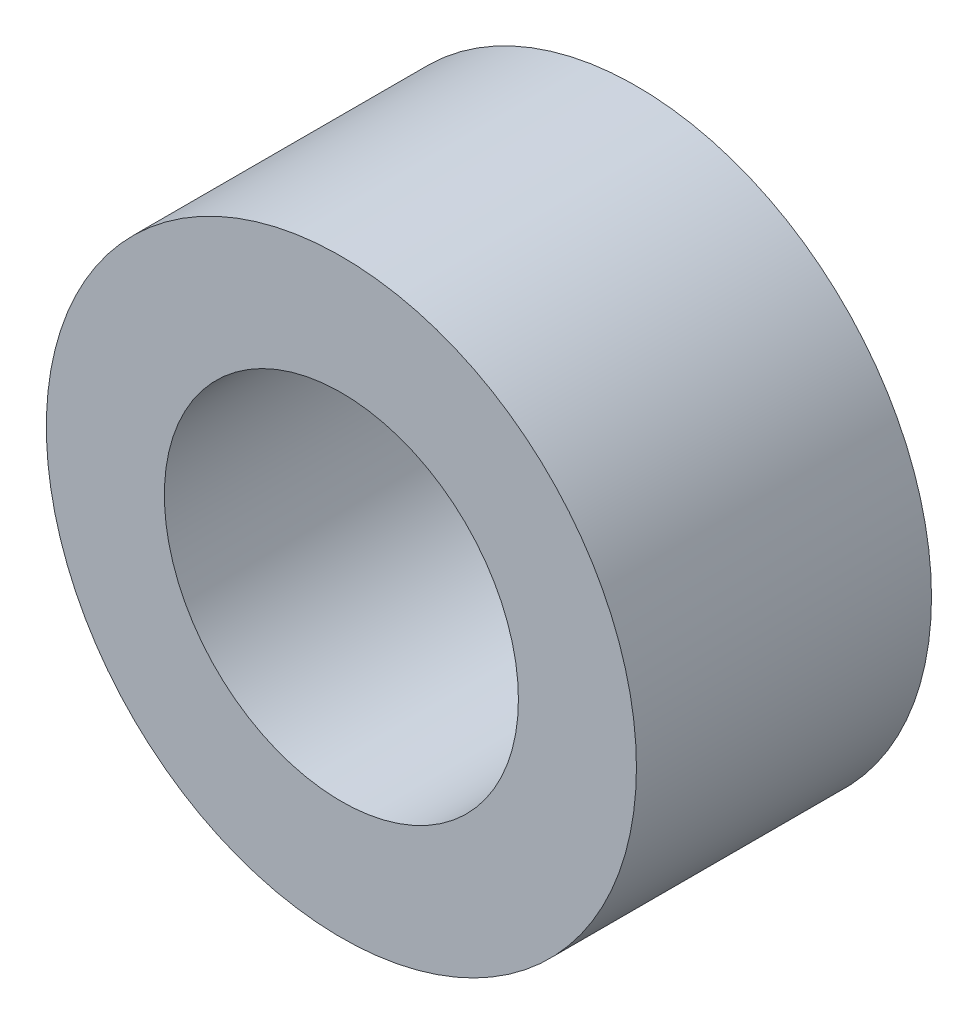
ISO-10303-21;
HEADER;
FILE_DESCRIPTION(('STEP AP214'),'2;1');
FILE_NAME('part.step','',(''),(''),'','','');
FILE_SCHEMA(('AUTOMOTIVE_DESIGN { 1 0 10303 214 1 1 1 1 }'));
ENDSEC;
DATA;
#1=APPLICATION_CONTEXT('core data for automotive mechanical design processes');
#2=APPLICATION_PROTOCOL_DEFINITION('international standard','automotive_design',2000,#1);
#3=PRODUCT_CONTEXT('',#1,'mechanical');
#4=PRODUCT('Part','Part','',(#3));
#5=PRODUCT_RELATED_PRODUCT_CATEGORY('part','',(#4));
#6=PRODUCT_DEFINITION_FORMATION('','',#4);
#7=PRODUCT_DEFINITION_CONTEXT('part definition',#1,'design');
#8=PRODUCT_DEFINITION('design','',#6,#7);
#9=PRODUCT_DEFINITION_SHAPE('','',#8);
#10=(LENGTH_UNIT() NAMED_UNIT(*) SI_UNIT(.MILLI.,.METRE.));
#11=(NAMED_UNIT(*) PLANE_ANGLE_UNIT() SI_UNIT($,.RADIAN.));
#12=(NAMED_UNIT(*) SI_UNIT($,.STERADIAN.) SOLID_ANGLE_UNIT());
#13=UNCERTAINTY_MEASURE_WITH_UNIT(LENGTH_MEASURE(1.E-05),#10,'distance_accuracy_value','');
#14=(GEOMETRIC_REPRESENTATION_CONTEXT(3) GLOBAL_UNCERTAINTY_ASSIGNED_CONTEXT((#13)) GLOBAL_UNIT_ASSIGNED_CONTEXT((#10,
#11,#12)) REPRESENTATION_CONTEXT('',''));
#15=CARTESIAN_POINT('',(0.,0.,0.));
#16=DIRECTION('',(0.,0.,1.));
#17=DIRECTION('',(1.,0.,0.));
#18=AXIS2_PLACEMENT_3D('',#15,#16,#17);
#19=CARTESIAN_POINT('',(0.,0.,2.5));
#20=DIRECTION('',(0.,0.,1.));
#21=DIRECTION('',(1.,0.,0.));
#22=AXIS2_PLACEMENT_3D('',#19,#20,#21);
#23=PLANE('',#22);
#24=CARTESIAN_POINT('',(0.,0.,2.5));
#25=DIRECTION('',(0.,0.,1.));
#26=DIRECTION('',(1.,0.,0.));
#27=AXIS2_PLACEMENT_3D('',#24,#25,#26);
#28=CIRCLE('',#27,2.5);
#29=CARTESIAN_POINT('',(2.5,0.,2.5));
#30=VERTEX_POINT('',#29);
#31=EDGE_CURVE('E10',#30,#30,#28,.T.);
#32=ORIENTED_EDGE('',*,*,#31,.T.);
#33=EDGE_LOOP('',(#32));
#34=FACE_BOUND('',#33,.T.);
#35=CARTESIAN_POINT('',(0.,0.,2.5));
#36=DIRECTION('',(0.,0.,1.));
#37=DIRECTION('',(1.,0.,0.));
#38=AXIS2_PLACEMENT_3D('',#35,#36,#37);
#39=CIRCLE('',#38,1.5);
#40=CARTESIAN_POINT('',(1.5,0.,2.5));
#41=VERTEX_POINT('',#40);
#42=EDGE_CURVE('E50',#41,#41,#39,.T.);
#43=ORIENTED_EDGE('',*,*,#42,.F.);
#44=EDGE_LOOP('',(#43));
#45=FACE_BOUND('',#44,.T.);
#46=ADVANCED_FACE('F37',(#34,#45),#23,.T.);
#47=CARTESIAN_POINT('',(0.,0.,0.));
#48=DIRECTION('',(0.,0.,1.));
#49=DIRECTION('',(1.,0.,0.));
#50=AXIS2_PLACEMENT_3D('',#47,#48,#49);
#51=PLANE('',#50);
#52=CARTESIAN_POINT('',(0.,0.,0.));
#53=DIRECTION('',(0.,0.,1.));
#54=DIRECTION('',(1.,0.,0.));
#55=AXIS2_PLACEMENT_3D('',#52,#53,#54);
#56=CIRCLE('',#55,2.5);
#57=CARTESIAN_POINT('',(2.5,0.,0.));
#58=VERTEX_POINT('',#57);
#59=EDGE_CURVE('E41',#58,#58,#56,.T.);
#60=ORIENTED_EDGE('',*,*,#59,.F.);
#61=EDGE_LOOP('',(#60));
#62=FACE_BOUND('',#61,.T.);
#63=CARTESIAN_POINT('',(0.,0.,0.));
#64=DIRECTION('',(0.,0.,1.));
#65=DIRECTION('',(1.,0.,0.));
#66=AXIS2_PLACEMENT_3D('',#63,#64,#65);
#67=CIRCLE('',#66,1.5);
#68=CARTESIAN_POINT('',(1.5,0.,0.));
#69=VERTEX_POINT('',#68);
#70=EDGE_CURVE('E52',#69,#69,#67,.T.);
#71=ORIENTED_EDGE('',*,*,#70,.T.);
#72=EDGE_LOOP('',(#71));
#73=FACE_BOUND('',#72,.T.);
#74=ADVANCED_FACE('F64',(#62,#73),#51,.F.);
#75=CARTESIAN_POINT('',(0.,0.,2.5));
#76=DIRECTION('',(0.,0.,-1.));
#77=DIRECTION('',(-1.,0.,0.));
#78=AXIS2_PLACEMENT_3D('',#75,#76,#77);
#79=CYLINDRICAL_SURFACE('',#78,2.5);
#80=ORIENTED_EDGE('',*,*,#31,.F.);
#81=EDGE_LOOP('',(#80));
#82=FACE_BOUND('',#81,.T.);
#83=ORIENTED_EDGE('',*,*,#59,.T.);
#84=EDGE_LOOP('',(#83));
#85=FACE_BOUND('',#84,.T.);
#86=ADVANCED_FACE('F39',(#82,#85),#79,.T.);
#87=CARTESIAN_POINT('',(0.,0.,2.5));
#88=DIRECTION('',(0.,0.,-1.));
#89=DIRECTION('',(-1.,0.,0.));
#90=AXIS2_PLACEMENT_3D('',#87,#88,#89);
#91=CYLINDRICAL_SURFACE('',#90,1.5);
#92=ORIENTED_EDGE('',*,*,#42,.T.);
#93=EDGE_LOOP('',(#92));
#94=FACE_BOUND('',#93,.T.);
#95=ORIENTED_EDGE('',*,*,#70,.F.);
#96=EDGE_LOOP('',(#95));
#97=FACE_BOUND('',#96,.T.);
#98=ADVANCED_FACE('F60',(#94,#97),#91,.F.);
#99=CLOSED_SHELL('',(#46,#74,#86,#98));
#100=MANIFOLD_SOLID_BREP('B2',#99);
#101=ADVANCED_BREP_SHAPE_REPRESENTATION('',(#18,#100),#14);
#102=SHAPE_DEFINITION_REPRESENTATION(#9,#101);
ENDSEC;
END-ISO-10303-21;
